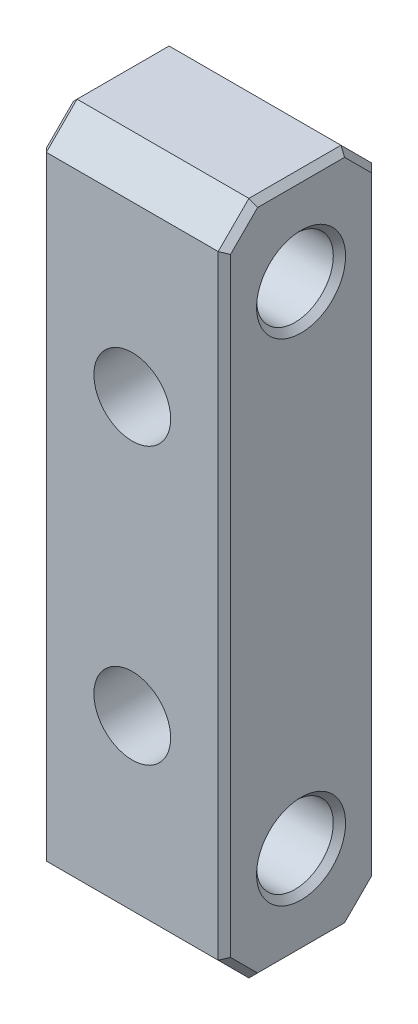
ISO-10303-21;
HEADER;
FILE_DESCRIPTION(('STEP AP214'),'2;1');
FILE_NAME('part.step','',(''),(''),'','','');
FILE_SCHEMA(('AUTOMOTIVE_DESIGN { 1 0 10303 214 1 1 1 1 }'));
ENDSEC;
DATA;
#1=APPLICATION_CONTEXT('core data for automotive mechanical design processes');
#2=APPLICATION_PROTOCOL_DEFINITION('international standard','automotive_design',2000,#1);
#3=PRODUCT_CONTEXT('',#1,'mechanical');
#4=PRODUCT('Part','Part','',(#3));
#5=PRODUCT_RELATED_PRODUCT_CATEGORY('part','',(#4));
#6=PRODUCT_DEFINITION_FORMATION('','',#4);
#7=PRODUCT_DEFINITION_CONTEXT('part definition',#1,'design');
#8=PRODUCT_DEFINITION('design','',#6,#7);
#9=PRODUCT_DEFINITION_SHAPE('','',#8);
#10=(LENGTH_UNIT() NAMED_UNIT(*) SI_UNIT(.MILLI.,.METRE.));
#11=(NAMED_UNIT(*) PLANE_ANGLE_UNIT() SI_UNIT($,.RADIAN.));
#12=(NAMED_UNIT(*) SI_UNIT($,.STERADIAN.) SOLID_ANGLE_UNIT());
#13=UNCERTAINTY_MEASURE_WITH_UNIT(LENGTH_MEASURE(1.E-05),#10,'distance_accuracy_value','');
#14=(GEOMETRIC_REPRESENTATION_CONTEXT(3) GLOBAL_UNCERTAINTY_ASSIGNED_CONTEXT((#13)) GLOBAL_UNIT_ASSIGNED_CONTEXT((#10,
#11,#12)) REPRESENTATION_CONTEXT('',''));
#15=CARTESIAN_POINT('',(0.,0.,0.));
#16=DIRECTION('',(0.,0.,1.));
#17=DIRECTION('',(1.,0.,0.));
#18=AXIS2_PLACEMENT_3D('',#15,#16,#17);
#19=CARTESIAN_POINT('',(3.,11.,2.5));
#20=DIRECTION('',(-1.,0.,0.));
#21=DIRECTION('',(0.,-1.,0.));
#22=AXIS2_PLACEMENT_3D('',#19,#20,#21);
#23=PLANE('',#22);
#24=DIRECTION('',(0.,-1.,0.));
#25=VECTOR('',#24,1.);
#26=CARTESIAN_POINT('',(3.,-10.,2.3));
#27=LINE('',#26,#25);
#28=CARTESIAN_POINT('',(3.,9.91715728752538,2.3));
#29=VERTEX_POINT('',#28);
#30=CARTESIAN_POINT('',(3.,-9.91715728752538,2.3));
#31=VERTEX_POINT('',#30);
#32=EDGE_CURVE('E47',#29,#31,#27,.T.);
#33=ORIENTED_EDGE('',*,*,#32,.T.);
#34=DIRECTION('',(0.,-0.707106781186548,-0.707106781186548));
#35=VECTOR('',#34,1.);
#36=CARTESIAN_POINT('',(3.,-10.8585786437627,1.35857864376269));
#37=LINE('',#36,#35);
#38=CARTESIAN_POINT('',(3.,-10.8,1.41715728752538));
#39=VERTEX_POINT('',#38);
#40=EDGE_CURVE('E11',#31,#39,#37,.T.);
#41=ORIENTED_EDGE('',*,*,#40,.T.);
#42=DIRECTION('',(0.,0.,-1.));
#43=VECTOR('',#42,1.);
#44=CARTESIAN_POINT('',(3.,-10.8,2.5));
#45=LINE('',#44,#43);
#46=CARTESIAN_POINT('',(3.,-10.8,-1.41715728752538));
#47=VERTEX_POINT('',#46);
#48=EDGE_CURVE('E233',#39,#47,#45,.T.);
#49=ORIENTED_EDGE('',*,*,#48,.T.);
#50=DIRECTION('',(0.,0.707106781186549,-0.707106781186546));
#51=VECTOR('',#50,1.);
#52=CARTESIAN_POINT('',(3.,-9.85857864376268,-2.35857864376269));
#53=LINE('',#52,#51);
#54=CARTESIAN_POINT('',(3.,-9.91715728752538,-2.3));
#55=VERTEX_POINT('',#54);
#56=EDGE_CURVE('E235',#47,#55,#53,.T.);
#57=ORIENTED_EDGE('',*,*,#56,.T.);
#58=DIRECTION('',(0.,1.,0.));
#59=VECTOR('',#58,1.);
#60=CARTESIAN_POINT('',(3.,11.,-2.3));
#61=LINE('',#60,#59);
#62=CARTESIAN_POINT('',(3.,9.91715728752538,-2.3));
#63=VERTEX_POINT('',#62);
#64=EDGE_CURVE('E237',#55,#63,#61,.T.);
#65=ORIENTED_EDGE('',*,*,#64,.T.);
#66=DIRECTION('',(0.,0.707106781186549,0.707106781186546));
#67=VECTOR('',#66,1.);
#68=CARTESIAN_POINT('',(3.,10.8585786437627,-1.35857864376269));
#69=LINE('',#68,#67);
#70=CARTESIAN_POINT('',(3.,10.8,-1.41715728752538));
#71=VERTEX_POINT('',#70);
#72=EDGE_CURVE('E239',#63,#71,#69,.T.);
#73=ORIENTED_EDGE('',*,*,#72,.T.);
#74=DIRECTION('',(0.,0.,1.));
#75=VECTOR('',#74,1.);
#76=CARTESIAN_POINT('',(3.,10.8,2.5));
#77=LINE('',#76,#75);
#78=CARTESIAN_POINT('',(3.,10.8,1.41715728752538));
#79=VERTEX_POINT('',#78);
#80=EDGE_CURVE('E241',#71,#79,#77,.T.);
#81=ORIENTED_EDGE('',*,*,#80,.T.);
#82=DIRECTION('',(0.,-0.707106781186548,0.707106781186548));
#83=VECTOR('',#82,1.);
#84=CARTESIAN_POINT('',(3.,9.85857864376269,2.35857864376269));
#85=LINE('',#84,#83);
#86=EDGE_CURVE('E58',#79,#29,#85,.T.);
#87=ORIENTED_EDGE('',*,*,#86,.T.);
#88=EDGE_LOOP('',(#33,#41,#49,#57,#65,#73,#81,#87));
#89=FACE_BOUND('',#88,.T.);
#90=CARTESIAN_POINT('',(3.,-8.,0.));
#91=DIRECTION('',(-1.,0.,0.));
#92=DIRECTION('',(0.,-1.,0.));
#93=AXIS2_PLACEMENT_3D('',#90,#91,#92);
#94=CIRCLE('',#93,1.45000000000001);
#95=CARTESIAN_POINT('',(3.,-9.45000000000001,0.));
#96=VERTEX_POINT('',#95);
#97=EDGE_CURVE('E230',#96,#96,#94,.T.);
#98=ORIENTED_EDGE('',*,*,#97,.T.);
#99=EDGE_LOOP('',(#98));
#100=FACE_BOUND('',#99,.T.);
#101=CARTESIAN_POINT('',(3.,8.,0.));
#102=DIRECTION('',(-1.,0.,0.));
#103=DIRECTION('',(0.,-1.,0.));
#104=AXIS2_PLACEMENT_3D('',#101,#102,#103);
#105=CIRCLE('',#104,1.45);
#106=CARTESIAN_POINT('',(3.,6.55,0.));
#107=VERTEX_POINT('',#106);
#108=EDGE_CURVE('E227',#107,#107,#105,.T.);
#109=ORIENTED_EDGE('',*,*,#108,.T.);
#110=EDGE_LOOP('',(#109));
#111=FACE_BOUND('',#110,.T.);
#112=ADVANCED_FACE('F38',(#89,#100,#111),#23,.F.);
#113=CARTESIAN_POINT('',(-3.,11.,2.5));
#114=DIRECTION('',(0.,-1.,0.));
#115=DIRECTION('',(0.,0.,-1.));
#116=AXIS2_PLACEMENT_3D('',#113,#114,#115);
#117=PLANE('',#116);
#118=DIRECTION('',(-1.,0.,0.));
#119=VECTOR('',#118,1.);
#120=CARTESIAN_POINT('',(-3.,11.,-1.5));
#121=LINE('',#120,#119);
#122=CARTESIAN_POINT('',(2.8,11.,-1.5));
#123=VERTEX_POINT('',#122);
#124=CARTESIAN_POINT('',(-2.8,11.,-1.5));
#125=VERTEX_POINT('',#124);
#126=EDGE_CURVE('E302',#123,#125,#121,.T.);
#127=ORIENTED_EDGE('',*,*,#126,.T.);
#128=DIRECTION('',(0.,0.,1.));
#129=VECTOR('',#128,1.);
#130=CARTESIAN_POINT('',(-2.8,11.,2.5));
#131=LINE('',#130,#129);
#132=CARTESIAN_POINT('',(-2.8,11.,1.5));
#133=VERTEX_POINT('',#132);
#134=EDGE_CURVE('E188',#125,#133,#131,.T.);
#135=ORIENTED_EDGE('',*,*,#134,.T.);
#136=DIRECTION('',(1.,0.,0.));
#137=VECTOR('',#136,1.);
#138=CARTESIAN_POINT('',(3.,11.,1.5));
#139=LINE('',#138,#137);
#140=CARTESIAN_POINT('',(2.8,11.,1.5));
#141=VERTEX_POINT('',#140);
#142=EDGE_CURVE('E322',#133,#141,#139,.T.);
#143=ORIENTED_EDGE('',*,*,#142,.T.);
#144=DIRECTION('',(0.,0.,-1.));
#145=VECTOR('',#144,1.);
#146=CARTESIAN_POINT('',(2.8,11.,2.5));
#147=LINE('',#146,#145);
#148=EDGE_CURVE('E186',#141,#123,#147,.T.);
#149=ORIENTED_EDGE('',*,*,#148,.T.);
#150=EDGE_LOOP('',(#127,#135,#143,#149));
#151=FACE_BOUND('',#150,.T.);
#152=ADVANCED_FACE('F349',(#151),#117,.F.);
#153=CARTESIAN_POINT('',(-3.,11.,2.5));
#154=DIRECTION('',(1.,0.,0.));
#155=DIRECTION('',(0.,1.,0.));
#156=AXIS2_PLACEMENT_3D('',#153,#154,#155);
#157=PLANE('',#156);
#158=DIRECTION('',(0.,0.,-1.));
#159=VECTOR('',#158,1.);
#160=CARTESIAN_POINT('',(-3.,10.8,2.5));
#161=LINE('',#160,#159);
#162=CARTESIAN_POINT('',(-3.,10.8,1.41715728752538));
#163=VERTEX_POINT('',#162);
#164=CARTESIAN_POINT('',(-3.,10.8,-1.41715728752538));
#165=VERTEX_POINT('',#164);
#166=EDGE_CURVE('E176',#163,#165,#161,.T.);
#167=ORIENTED_EDGE('',*,*,#166,.T.);
#168=DIRECTION('',(0.,-0.707106781186549,-0.707106781186546));
#169=VECTOR('',#168,1.);
#170=CARTESIAN_POINT('',(-3.,9.85857864376269,-2.35857864376269));
#171=LINE('',#170,#169);
#172=CARTESIAN_POINT('',(-3.,9.91715728752538,-2.3));
#173=VERTEX_POINT('',#172);
#174=EDGE_CURVE('E156',#165,#173,#171,.T.);
#175=ORIENTED_EDGE('',*,*,#174,.T.);
#176=DIRECTION('',(0.,-1.,0.));
#177=VECTOR('',#176,1.);
#178=CARTESIAN_POINT('',(-3.,11.,-2.3));
#179=LINE('',#178,#177);
#180=CARTESIAN_POINT('',(-3.,-9.91715728752537,-2.3));
#181=VERTEX_POINT('',#180);
#182=EDGE_CURVE('E164',#173,#181,#179,.T.);
#183=ORIENTED_EDGE('',*,*,#182,.T.);
#184=DIRECTION('',(0.,-0.707106781186549,0.707106781186546));
#185=VECTOR('',#184,1.);
#186=CARTESIAN_POINT('',(-3.,-10.8585786437627,-1.35857864376269));
#187=LINE('',#186,#185);
#188=CARTESIAN_POINT('',(-3.,-10.8,-1.41715728752538));
#189=VERTEX_POINT('',#188);
#190=EDGE_CURVE('E170',#181,#189,#187,.T.);
#191=ORIENTED_EDGE('',*,*,#190,.T.);
#192=DIRECTION('',(0.,0.,1.));
#193=VECTOR('',#192,1.);
#194=CARTESIAN_POINT('',(-3.,-10.8,2.5));
#195=LINE('',#194,#193);
#196=CARTESIAN_POINT('',(-3.,-10.8,1.41715728752538));
#197=VERTEX_POINT('',#196);
#198=EDGE_CURVE('E332',#189,#197,#195,.T.);
#199=ORIENTED_EDGE('',*,*,#198,.T.);
#200=DIRECTION('',(0.,0.707106781186548,0.707106781186548));
#201=VECTOR('',#200,1.);
#202=CARTESIAN_POINT('',(-3.,-9.85857864376269,2.35857864376269));
#203=LINE('',#202,#201);
#204=CARTESIAN_POINT('',(-3.,-9.91715728752538,2.3));
#205=VERTEX_POINT('',#204);
#206=EDGE_CURVE('E334',#197,#205,#203,.T.);
#207=ORIENTED_EDGE('',*,*,#206,.T.);
#208=DIRECTION('',(0.,1.,0.));
#209=VECTOR('',#208,1.);
#210=CARTESIAN_POINT('',(-3.,10.,2.3));
#211=LINE('',#210,#209);
#212=CARTESIAN_POINT('',(-3.,9.91715728752538,2.3));
#213=VERTEX_POINT('',#212);
#214=EDGE_CURVE('E336',#205,#213,#211,.T.);
#215=ORIENTED_EDGE('',*,*,#214,.T.);
#216=DIRECTION('',(0.,0.707106781186548,-0.707106781186548));
#217=VECTOR('',#216,1.);
#218=CARTESIAN_POINT('',(-3.,10.8585786437627,1.35857864376268));
#219=LINE('',#218,#217);
#220=EDGE_CURVE('E181',#213,#163,#219,.T.);
#221=ORIENTED_EDGE('',*,*,#220,.T.);
#222=EDGE_LOOP('',(#167,#175,#183,#191,#199,#207,#215,#221));
#223=FACE_BOUND('',#222,.T.);
#224=CARTESIAN_POINT('',(-3.,-8.,0.));
#225=DIRECTION('',(1.,0.,0.));
#226=DIRECTION('',(0.,1.,0.));
#227=AXIS2_PLACEMENT_3D('',#224,#225,#226);
#228=CIRCLE('',#227,1.45000000000001);
#229=CARTESIAN_POINT('',(-3.,-8.,1.45000000000001));
#230=VERTEX_POINT('',#229);
#231=EDGE_CURVE('E171',#230,#230,#228,.T.);
#232=ORIENTED_EDGE('',*,*,#231,.T.);
#233=EDGE_LOOP('',(#232));
#234=FACE_BOUND('',#233,.T.);
#235=CARTESIAN_POINT('',(-3.,8.,0.));
#236=DIRECTION('',(1.,0.,0.));
#237=DIRECTION('',(0.,1.,0.));
#238=AXIS2_PLACEMENT_3D('',#235,#236,#237);
#239=CIRCLE('',#238,1.45);
#240=CARTESIAN_POINT('',(-3.,9.45,0.));
#241=VERTEX_POINT('',#240);
#242=EDGE_CURVE('E326',#241,#241,#239,.T.);
#243=ORIENTED_EDGE('',*,*,#242,.T.);
#244=EDGE_LOOP('',(#243));
#245=FACE_BOUND('',#244,.T.);
#246=ADVANCED_FACE('F173',(#223,#234,#245),#157,.F.);
#247=CARTESIAN_POINT('',(-3.,-11.,2.5));
#248=DIRECTION('',(0.,1.,0.));
#249=DIRECTION('',(0.,0.,1.));
#250=AXIS2_PLACEMENT_3D('',#247,#248,#249);
#251=PLANE('',#250);
#252=DIRECTION('',(-1.,0.,0.));
#253=VECTOR('',#252,1.);
#254=CARTESIAN_POINT('',(-3.,-11.,1.5));
#255=LINE('',#254,#253);
#256=CARTESIAN_POINT('',(2.8,-11.,1.5));
#257=VERTEX_POINT('',#256);
#258=CARTESIAN_POINT('',(-2.8,-11.,1.5));
#259=VERTEX_POINT('',#258);
#260=EDGE_CURVE('E313',#257,#259,#255,.T.);
#261=ORIENTED_EDGE('',*,*,#260,.T.);
#262=DIRECTION('',(0.,0.,-1.));
#263=VECTOR('',#262,1.);
#264=CARTESIAN_POINT('',(-2.8,-11.,2.5));
#265=LINE('',#264,#263);
#266=CARTESIAN_POINT('',(-2.8,-11.,-1.5));
#267=VERTEX_POINT('',#266);
#268=EDGE_CURVE('E205',#259,#267,#265,.T.);
#269=ORIENTED_EDGE('',*,*,#268,.T.);
#270=DIRECTION('',(1.,0.,0.));
#271=VECTOR('',#270,1.);
#272=CARTESIAN_POINT('',(-3.,-11.,-1.5));
#273=LINE('',#272,#271);
#274=CARTESIAN_POINT('',(2.8,-11.,-1.5));
#275=VERTEX_POINT('',#274);
#276=EDGE_CURVE('E308',#267,#275,#273,.T.);
#277=ORIENTED_EDGE('',*,*,#276,.T.);
#278=DIRECTION('',(0.,0.,1.));
#279=VECTOR('',#278,1.);
#280=CARTESIAN_POINT('',(2.8,-11.,2.5));
#281=LINE('',#280,#279);
#282=EDGE_CURVE('E203',#275,#257,#281,.T.);
#283=ORIENTED_EDGE('',*,*,#282,.T.);
#284=EDGE_LOOP('',(#261,#269,#277,#283));
#285=FACE_BOUND('',#284,.T.);
#286=ADVANCED_FACE('F378',(#285),#251,.F.);
#287=CARTESIAN_POINT('',(0.,0.,2.5));
#288=DIRECTION('',(0.,0.,1.));
#289=DIRECTION('',(1.,0.,0.));
#290=AXIS2_PLACEMENT_3D('',#287,#288,#289);
#291=PLANE('',#290);
#292=CARTESIAN_POINT('',(0.,4.5,2.5));
#293=DIRECTION('',(0.,0.,1.));
#294=DIRECTION('',(1.,0.,0.));
#295=AXIS2_PLACEMENT_3D('',#292,#293,#294);
#296=CIRCLE('',#295,1.25);
#297=CARTESIAN_POINT('',(1.25,4.5,2.5));
#298=VERTEX_POINT('',#297);
#299=EDGE_CURVE('E392',#298,#298,#296,.T.);
#300=ORIENTED_EDGE('',*,*,#299,.F.);
#301=EDGE_LOOP('',(#300));
#302=FACE_BOUND('',#301,.T.);
#303=CARTESIAN_POINT('',(0.,-4.5,2.5));
#304=DIRECTION('',(0.,0.,1.));
#305=DIRECTION('',(-1.,0.,0.));
#306=AXIS2_PLACEMENT_3D('',#303,#304,#305);
#307=CIRCLE('',#306,1.25);
#308=CARTESIAN_POINT('',(-1.25,-4.5,2.5));
#309=VERTEX_POINT('',#308);
#310=EDGE_CURVE('E262',#309,#309,#307,.T.);
#311=ORIENTED_EDGE('',*,*,#310,.F.);
#312=EDGE_LOOP('',(#311));
#313=FACE_BOUND('',#312,.T.);
#314=DIRECTION('',(-1.,0.,0.));
#315=VECTOR('',#314,1.);
#316=CARTESIAN_POINT('',(-3.,10.,2.5));
#317=LINE('',#316,#315);
#318=CARTESIAN_POINT('',(2.8,10.,2.5));
#319=VERTEX_POINT('',#318);
#320=CARTESIAN_POINT('',(-2.8,10.,2.5));
#321=VERTEX_POINT('',#320);
#322=EDGE_CURVE('E310',#319,#321,#317,.T.);
#323=ORIENTED_EDGE('',*,*,#322,.T.);
#324=DIRECTION('',(0.,-1.,0.));
#325=VECTOR('',#324,1.);
#326=CARTESIAN_POINT('',(-2.8,-10.,2.5));
#327=LINE('',#326,#325);
#328=CARTESIAN_POINT('',(-2.8,-10.,2.5));
#329=VERTEX_POINT('',#328);
#330=EDGE_CURVE('E196',#321,#329,#327,.T.);
#331=ORIENTED_EDGE('',*,*,#330,.T.);
#332=DIRECTION('',(1.,0.,0.));
#333=VECTOR('',#332,1.);
#334=CARTESIAN_POINT('',(3.,-10.,2.5));
#335=LINE('',#334,#333);
#336=CARTESIAN_POINT('',(2.8,-10.,2.5));
#337=VERTEX_POINT('',#336);
#338=EDGE_CURVE('E319',#329,#337,#335,.T.);
#339=ORIENTED_EDGE('',*,*,#338,.T.);
#340=DIRECTION('',(0.,1.,0.));
#341=VECTOR('',#340,1.);
#342=CARTESIAN_POINT('',(2.8,10.,2.5));
#343=LINE('',#342,#341);
#344=EDGE_CURVE('E194',#337,#319,#343,.T.);
#345=ORIENTED_EDGE('',*,*,#344,.T.);
#346=EDGE_LOOP('',(#323,#331,#339,#345));
#347=FACE_BOUND('',#346,.T.);
#348=ADVANCED_FACE('F401',(#302,#313,#347),#291,.T.);
#349=CARTESIAN_POINT('',(0.,0.,-2.5));
#350=DIRECTION('',(0.,0.,1.));
#351=DIRECTION('',(1.,0.,0.));
#352=AXIS2_PLACEMENT_3D('',#349,#350,#351);
#353=PLANE('',#352);
#354=CARTESIAN_POINT('',(0.,4.5,-2.5));
#355=DIRECTION('',(0.,0.,1.));
#356=DIRECTION('',(1.,0.,0.));
#357=AXIS2_PLACEMENT_3D('',#354,#355,#356);
#358=CIRCLE('',#357,1.25);
#359=CARTESIAN_POINT('',(1.25,4.5,-2.5));
#360=VERTEX_POINT('',#359);
#361=EDGE_CURVE('E385',#360,#360,#358,.T.);
#362=ORIENTED_EDGE('',*,*,#361,.T.);
#363=EDGE_LOOP('',(#362));
#364=FACE_BOUND('',#363,.T.);
#365=CARTESIAN_POINT('',(0.,-4.5,-2.5));
#366=DIRECTION('',(0.,0.,1.));
#367=DIRECTION('',(1.,0.,0.));
#368=AXIS2_PLACEMENT_3D('',#365,#366,#367);
#369=CIRCLE('',#368,1.25);
#370=CARTESIAN_POINT('',(1.25,-4.5,-2.5));
#371=VERTEX_POINT('',#370);
#372=EDGE_CURVE('E387',#371,#371,#369,.T.);
#373=ORIENTED_EDGE('',*,*,#372,.T.);
#374=EDGE_LOOP('',(#373));
#375=FACE_BOUND('',#374,.T.);
#376=DIRECTION('',(-1.,0.,0.));
#377=VECTOR('',#376,1.);
#378=CARTESIAN_POINT('',(0.,-9.99999999999999,-2.5));
#379=LINE('',#378,#377);
#380=CARTESIAN_POINT('',(2.8,-9.99999999999999,-2.5));
#381=VERTEX_POINT('',#380);
#382=CARTESIAN_POINT('',(-2.8,-9.99999999999999,-2.5));
#383=VERTEX_POINT('',#382);
#384=EDGE_CURVE('E307',#381,#383,#379,.T.);
#385=ORIENTED_EDGE('',*,*,#384,.T.);
#386=DIRECTION('',(0.,1.,0.));
#387=VECTOR('',#386,1.);
#388=CARTESIAN_POINT('',(-2.8,0.,-2.5));
#389=LINE('',#388,#387);
#390=CARTESIAN_POINT('',(-2.8,10.,-2.5));
#391=VERTEX_POINT('',#390);
#392=EDGE_CURVE('E213',#383,#391,#389,.T.);
#393=ORIENTED_EDGE('',*,*,#392,.T.);
#394=DIRECTION('',(1.,0.,0.));
#395=VECTOR('',#394,1.);
#396=CARTESIAN_POINT('',(0.,10.,-2.5));
#397=LINE('',#396,#395);
#398=CARTESIAN_POINT('',(2.8,10.,-2.5));
#399=VERTEX_POINT('',#398);
#400=EDGE_CURVE('E300',#391,#399,#397,.T.);
#401=ORIENTED_EDGE('',*,*,#400,.T.);
#402=DIRECTION('',(0.,-1.,0.));
#403=VECTOR('',#402,1.);
#404=CARTESIAN_POINT('',(2.8,0.,-2.5));
#405=LINE('',#404,#403);
#406=EDGE_CURVE('E211',#399,#381,#405,.T.);
#407=ORIENTED_EDGE('',*,*,#406,.T.);
#408=EDGE_LOOP('',(#385,#393,#401,#407));
#409=FACE_BOUND('',#408,.T.);
#410=ADVANCED_FACE('F305',(#364,#375,#409),#353,.F.);
#411=CARTESIAN_POINT('',(0.,-4.5,-6.5));
#412=DIRECTION('',(0.,0.,1.));
#413=DIRECTION('',(1.,0.,0.));
#414=AXIS2_PLACEMENT_3D('',#411,#412,#413);
#415=CYLINDRICAL_SURFACE('',#414,1.25);
#416=ORIENTED_EDGE('',*,*,#310,.T.);
#417=EDGE_LOOP('',(#416));
#418=FACE_BOUND('',#417,.T.);
#419=ORIENTED_EDGE('',*,*,#372,.F.);
#420=EDGE_LOOP('',(#419));
#421=FACE_BOUND('',#420,.T.);
#422=ADVANCED_FACE('F643',(#418,#421),#415,.F.);
#423=CARTESIAN_POINT('',(0.,4.5,-6.5));
#424=DIRECTION('',(0.,0.,1.));
#425=DIRECTION('',(1.,0.,0.));
#426=AXIS2_PLACEMENT_3D('',#423,#424,#425);
#427=CYLINDRICAL_SURFACE('',#426,1.25);
#428=ORIENTED_EDGE('',*,*,#299,.T.);
#429=EDGE_LOOP('',(#428));
#430=FACE_BOUND('',#429,.T.);
#431=ORIENTED_EDGE('',*,*,#361,.F.);
#432=EDGE_LOOP('',(#431));
#433=FACE_BOUND('',#432,.T.);
#434=ADVANCED_FACE('F398',(#430,#433),#427,.F.);
#435=CARTESIAN_POINT('',(6.,-8.,0.));
#436=DIRECTION('',(-1.,0.,0.));
#437=DIRECTION('',(0.,-1.,0.));
#438=AXIS2_PLACEMENT_3D('',#435,#436,#437);
#439=CYLINDRICAL_SURFACE('',#438,1.25);
#440=CARTESIAN_POINT('',(-2.79999999999999,-8.,0.));
#441=DIRECTION('',(1.,0.,0.));
#442=DIRECTION('',(0.,0.,-1.));
#443=AXIS2_PLACEMENT_3D('',#440,#441,#442);
#444=CIRCLE('',#443,1.25);
#445=CARTESIAN_POINT('',(-2.79999999999999,-8.,1.25));
#446=VERTEX_POINT('',#445);
#447=EDGE_CURVE('E218',#446,#446,#444,.F.);
#448=ORIENTED_EDGE('',*,*,#447,.T.);
#449=EDGE_LOOP('',(#448));
#450=FACE_BOUND('',#449,.T.);
#451=CARTESIAN_POINT('',(2.79999999999999,-8.,0.));
#452=DIRECTION('',(-1.,0.,0.));
#453=DIRECTION('',(0.,0.,1.));
#454=AXIS2_PLACEMENT_3D('',#451,#452,#453);
#455=CIRCLE('',#454,1.25);
#456=CARTESIAN_POINT('',(2.79999999999999,-8.,1.25));
#457=VERTEX_POINT('',#456);
#458=EDGE_CURVE('E215',#457,#457,#455,.F.);
#459=ORIENTED_EDGE('',*,*,#458,.T.);
#460=EDGE_LOOP('',(#459));
#461=FACE_BOUND('',#460,.T.);
#462=ADVANCED_FACE('F623',(#450,#461),#439,.F.);
#463=CARTESIAN_POINT('',(6.,8.,0.));
#464=DIRECTION('',(-1.,0.,0.));
#465=DIRECTION('',(0.,-1.,0.));
#466=AXIS2_PLACEMENT_3D('',#463,#464,#465);
#467=CYLINDRICAL_SURFACE('',#466,1.25);
#468=CARTESIAN_POINT('',(-2.8,8.,0.));
#469=DIRECTION('',(1.,0.,0.));
#470=DIRECTION('',(0.,0.,-1.));
#471=AXIS2_PLACEMENT_3D('',#468,#469,#470);
#472=CIRCLE('',#471,1.25);
#473=CARTESIAN_POINT('',(-2.8,8.,-1.25));
#474=VERTEX_POINT('',#473);
#475=EDGE_CURVE('E224',#474,#474,#472,.F.);
#476=ORIENTED_EDGE('',*,*,#475,.T.);
#477=EDGE_LOOP('',(#476));
#478=FACE_BOUND('',#477,.T.);
#479=CARTESIAN_POINT('',(2.8,8.,0.));
#480=DIRECTION('',(-1.,0.,0.));
#481=DIRECTION('',(0.,0.,1.));
#482=AXIS2_PLACEMENT_3D('',#479,#480,#481);
#483=CIRCLE('',#482,1.25);
#484=CARTESIAN_POINT('',(2.8,8.,1.25));
#485=VERTEX_POINT('',#484);
#486=EDGE_CURVE('E221',#485,#485,#483,.F.);
#487=ORIENTED_EDGE('',*,*,#486,.T.);
#488=EDGE_LOOP('',(#487));
#489=FACE_BOUND('',#488,.T.);
#490=ADVANCED_FACE('F441',(#478,#489),#467,.F.);
#491=CARTESIAN_POINT('',(-3.,-11.,-1.5));
#492=DIRECTION('',(0.,0.707106781186546,0.707106781186549));
#493=DIRECTION('',(1.,0.,0.));
#494=AXIS2_PLACEMENT_3D('',#491,#492,#493);
#495=PLANE('',#494);
#496=ORIENTED_EDGE('',*,*,#276,.F.);
#497=DIRECTION('',(0.,-0.707106781186549,0.707106781186546));
#498=VECTOR('',#497,1.);
#499=CARTESIAN_POINT('',(-2.8,-9.99999999999999,-2.5));
#500=LINE('',#499,#498);
#501=EDGE_CURVE('E209',#267,#383,#500,.F.);
#502=ORIENTED_EDGE('',*,*,#501,.T.);
#503=ORIENTED_EDGE('',*,*,#384,.F.);
#504=DIRECTION('',(0.,0.707106781186549,-0.707106781186546));
#505=VECTOR('',#504,1.);
#506=CARTESIAN_POINT('',(2.8,-11.,-1.5));
#507=LINE('',#506,#505);
#508=EDGE_CURVE('E207',#381,#275,#507,.F.);
#509=ORIENTED_EDGE('',*,*,#508,.T.);
#510=EDGE_LOOP('',(#496,#502,#503,#509));
#511=FACE_BOUND('',#510,.T.);
#512=ADVANCED_FACE('F421',(#511),#495,.F.);
#513=CARTESIAN_POINT('',(0.,-10.,2.5));
#514=DIRECTION('',(0.,-0.707106781186548,0.707106781186548));
#515=DIRECTION('',(-1.,0.,0.));
#516=AXIS2_PLACEMENT_3D('',#513,#514,#515);
#517=PLANE('',#516);
#518=ORIENTED_EDGE('',*,*,#338,.F.);
#519=DIRECTION('',(0.,-0.707106781186548,-0.707106781186548));
#520=VECTOR('',#519,1.);
#521=CARTESIAN_POINT('',(-2.8,-11.,1.5));
#522=LINE('',#521,#520);
#523=EDGE_CURVE('E201',#329,#259,#522,.T.);
#524=ORIENTED_EDGE('',*,*,#523,.T.);
#525=ORIENTED_EDGE('',*,*,#260,.F.);
#526=DIRECTION('',(0.,0.707106781186548,0.707106781186548));
#527=VECTOR('',#526,1.);
#528=CARTESIAN_POINT('',(2.8,-10.,2.5));
#529=LINE('',#528,#527);
#530=EDGE_CURVE('E198',#257,#337,#529,.T.);
#531=ORIENTED_EDGE('',*,*,#530,.T.);
#532=EDGE_LOOP('',(#518,#524,#525,#531));
#533=FACE_BOUND('',#532,.T.);
#534=ADVANCED_FACE('F383',(#533),#517,.T.);
#535=CARTESIAN_POINT('',(-3.,11.,-1.5));
#536=DIRECTION('',(0.,-0.707106781186546,0.707106781186549));
#537=DIRECTION('',(-1.,0.,0.));
#538=AXIS2_PLACEMENT_3D('',#535,#536,#537);
#539=PLANE('',#538);
#540=ORIENTED_EDGE('',*,*,#400,.F.);
#541=DIRECTION('',(0.,-0.707106781186549,-0.707106781186546));
#542=VECTOR('',#541,1.);
#543=CARTESIAN_POINT('',(-2.8,11.,-1.5));
#544=LINE('',#543,#542);
#545=EDGE_CURVE('E158',#391,#125,#544,.F.);
#546=ORIENTED_EDGE('',*,*,#545,.T.);
#547=ORIENTED_EDGE('',*,*,#126,.F.);
#548=DIRECTION('',(0.,0.707106781186549,0.707106781186546));
#549=VECTOR('',#548,1.);
#550=CARTESIAN_POINT('',(2.8,10.,-2.5));
#551=LINE('',#550,#549);
#552=EDGE_CURVE('E178',#123,#399,#551,.F.);
#553=ORIENTED_EDGE('',*,*,#552,.T.);
#554=EDGE_LOOP('',(#540,#546,#547,#553));
#555=FACE_BOUND('',#554,.T.);
#556=ADVANCED_FACE('F299',(#555),#539,.F.);
#557=CARTESIAN_POINT('',(0.,10.,2.5));
#558=DIRECTION('',(0.,0.707106781186548,0.707106781186548));
#559=DIRECTION('',(1.,0.,0.));
#560=AXIS2_PLACEMENT_3D('',#557,#558,#559);
#561=PLANE('',#560);
#562=ORIENTED_EDGE('',*,*,#142,.F.);
#563=DIRECTION('',(0.,-0.707106781186548,0.707106781186548));
#564=VECTOR('',#563,1.);
#565=CARTESIAN_POINT('',(-2.8,10.,2.5));
#566=LINE('',#565,#564);
#567=EDGE_CURVE('E192',#133,#321,#566,.T.);
#568=ORIENTED_EDGE('',*,*,#567,.T.);
#569=ORIENTED_EDGE('',*,*,#322,.F.);
#570=DIRECTION('',(0.,0.707106781186548,-0.707106781186548));
#571=VECTOR('',#570,1.);
#572=CARTESIAN_POINT('',(2.8,11.,1.5));
#573=LINE('',#572,#571);
#574=EDGE_CURVE('E190',#319,#141,#573,.T.);
#575=ORIENTED_EDGE('',*,*,#574,.T.);
#576=EDGE_LOOP('',(#562,#568,#569,#575));
#577=FACE_BOUND('',#576,.T.);
#578=ADVANCED_FACE('F351',(#577),#561,.T.);
#579=CARTESIAN_POINT('',(-3.,0.641421356237312,12.8585786437627));
#580=DIRECTION('',(-0.707106781186549,-0.499999999999999,0.499999999999999));
#581=DIRECTION('',(0.,-0.707106781186548,-0.707106781186548));
#582=AXIS2_PLACEMENT_3D('',#579,#580,#581);
#583=PLANE('',#582);
#584=DIRECTION('',(0.678598344545846,-0.678598344545846,0.281084637714824));
#585=VECTOR('',#584,1.);
#586=CARTESIAN_POINT('',(-2.60925643016945,-11.1907435698305,1.57900857355928));
#587=LINE('',#586,#585);
#588=EDGE_CURVE('E256',#259,#197,#587,.F.);
#589=ORIENTED_EDGE('',*,*,#588,.F.);
#590=ORIENTED_EDGE('',*,*,#523,.F.);
#591=DIRECTION('',(-0.678598344545846,0.281084637714824,-0.678598344545846));
#592=VECTOR('',#591,1.);
#593=CARTESIAN_POINT('',(-0.151800779695089,-11.0969200329162,5.1481992203049));
#594=LINE('',#593,#592);
#595=EDGE_CURVE('E259',#205,#329,#594,.F.);
#596=ORIENTED_EDGE('',*,*,#595,.F.);
#597=ORIENTED_EDGE('',*,*,#206,.F.);
#598=EDGE_LOOP('',(#589,#590,#596,#597));
#599=FACE_BOUND('',#598,.T.);
#600=ADVANCED_FACE('F413',(#599),#583,.T.);
#601=CARTESIAN_POINT('',(-2.8,0.,2.5));
#602=DIRECTION('',(-0.707106781186547,0.,0.707106781186547));
#603=DIRECTION('',(0.,1.,0.));
#604=AXIS2_PLACEMENT_3D('',#601,#602,#603);
#605=PLANE('',#604);
#606=ORIENTED_EDGE('',*,*,#595,.T.);
#607=ORIENTED_EDGE('',*,*,#330,.F.);
#608=DIRECTION('',(-0.678598344545847,-0.281084637714822,-0.678598344545847));
#609=VECTOR('',#608,1.);
#610=CARTESIAN_POINT('',(-4.70743569830547,9.20991426440727,0.592564301694527));
#611=LINE('',#610,#609);
#612=EDGE_CURVE('E253',#213,#321,#611,.F.);
#613=ORIENTED_EDGE('',*,*,#612,.F.);
#614=ORIENTED_EDGE('',*,*,#214,.F.);
#615=EDGE_LOOP('',(#606,#607,#613,#614));
#616=FACE_BOUND('',#615,.T.);
#617=ADVANCED_FACE('F409',(#616),#605,.T.);
#618=CARTESIAN_POINT('',(-2.8,-11.,2.5));
#619=DIRECTION('',(0.707106781186547,0.707106781186547,0.));
#620=DIRECTION('',(0.,0.,-1.));
#621=AXIS2_PLACEMENT_3D('',#618,#619,#620);
#622=PLANE('',#621);
#623=ORIENTED_EDGE('',*,*,#588,.T.);
#624=ORIENTED_EDGE('',*,*,#198,.F.);
#625=DIRECTION('',(-0.678598344545848,0.678598344545848,0.281084637714818));
#626=VECTOR('',#625,1.);
#627=CARTESIAN_POINT('',(-5.41196757579654,-8.38803242420345,-0.418087605626304));
#628=LINE('',#627,#626);
#629=EDGE_CURVE('E250',#267,#189,#628,.T.);
#630=ORIENTED_EDGE('',*,*,#629,.F.);
#631=ORIENTED_EDGE('',*,*,#268,.F.);
#632=EDGE_LOOP('',(#623,#624,#630,#631));
#633=FACE_BOUND('',#632,.T.);
#634=ADVANCED_FACE('F418',(#633),#622,.F.);
#635=CARTESIAN_POINT('',(-3.,10.3585786437627,1.85857864376269));
#636=DIRECTION('',(-0.707106781186548,0.499999999999999,0.499999999999999));
#637=DIRECTION('',(0.,-0.707106781186548,0.707106781186548));
#638=AXIS2_PLACEMENT_3D('',#635,#636,#637);
#639=PLANE('',#638);
#640=ORIENTED_EDGE('',*,*,#612,.T.);
#641=ORIENTED_EDGE('',*,*,#567,.F.);
#642=DIRECTION('',(0.678598344545847,0.678598344545847,0.281084637714823));
#643=VECTOR('',#642,1.);
#644=CARTESIAN_POINT('',(-3.11907435698306,10.6809256430169,1.36783507393214));
#645=LINE('',#644,#643);
#646=EDGE_CURVE('E247',#163,#133,#645,.T.);
#647=ORIENTED_EDGE('',*,*,#646,.F.);
#648=ORIENTED_EDGE('',*,*,#220,.F.);
#649=EDGE_LOOP('',(#640,#641,#647,#648));
#650=FACE_BOUND('',#649,.T.);
#651=ADVANCED_FACE('F343',(#650),#639,.T.);
#652=CARTESIAN_POINT('',(-3.,-1.85857864376265,-10.3585786437627));
#653=DIRECTION('',(0.707106781186546,0.5,0.500000000000002));
#654=DIRECTION('',(0.,-0.707106781186549,0.707106781186546));
#655=AXIS2_PLACEMENT_3D('',#652,#653,#654);
#656=PLANE('',#655);
#657=ORIENTED_EDGE('',*,*,#629,.T.);
#658=ORIENTED_EDGE('',*,*,#190,.F.);
#659=DIRECTION('',(-0.678598344545848,0.281084637714816,0.678598344545848));
#660=VECTOR('',#659,1.);
#661=CARTESIAN_POINT('',(-6.98981325172956,-8.26452252732311,1.68981325172957));
#662=LINE('',#661,#660);
#663=EDGE_CURVE('E167',#383,#181,#662,.T.);
#664=ORIENTED_EDGE('',*,*,#663,.F.);
#665=ORIENTED_EDGE('',*,*,#501,.F.);
#666=EDGE_LOOP('',(#657,#658,#664,#665));
#667=FACE_BOUND('',#666,.T.);
#668=ADVANCED_FACE('F455',(#667),#656,.F.);
#669=CARTESIAN_POINT('',(-3.,10.8,2.5));
#670=DIRECTION('',(0.707106781186547,-0.707106781186547,0.));
#671=DIRECTION('',(0.,0.,-1.));
#672=AXIS2_PLACEMENT_3D('',#669,#670,#671);
#673=PLANE('',#672);
#674=ORIENTED_EDGE('',*,*,#646,.T.);
#675=ORIENTED_EDGE('',*,*,#134,.F.);
#676=DIRECTION('',(-0.678598344545847,-0.678598344545847,0.28108463771482));
#677=VECTOR('',#676,1.);
#678=CARTESIAN_POINT('',(-3.74717256461033,10.0528274353897,-1.10766827783069));
#679=LINE('',#678,#677);
#680=EDGE_CURVE('E161',#165,#125,#679,.F.);
#681=ORIENTED_EDGE('',*,*,#680,.F.);
#682=ORIENTED_EDGE('',*,*,#166,.F.);
#683=EDGE_LOOP('',(#674,#675,#681,#682));
#684=FACE_BOUND('',#683,.T.);
#685=ADVANCED_FACE('F346',(#684),#673,.F.);
#686=CARTESIAN_POINT('',(-3.,11.,-2.3));
#687=DIRECTION('',(0.707106781186547,0.,0.707106781186547));
#688=DIRECTION('',(0.,-1.,0.));
#689=AXIS2_PLACEMENT_3D('',#686,#687,#688);
#690=PLANE('',#689);
#691=ORIENTED_EDGE('',*,*,#663,.T.);
#692=ORIENTED_EDGE('',*,*,#182,.F.);
#693=DIRECTION('',(0.678598344545848,0.281084637714818,-0.678598344545848));
#694=VECTOR('',#693,1.);
#695=CARTESIAN_POINT('',(-2.7934547154576,10.002711145627,-2.5065452845424));
#696=LINE('',#695,#694);
#697=EDGE_CURVE('E152',#391,#173,#696,.F.);
#698=ORIENTED_EDGE('',*,*,#697,.F.);
#699=ORIENTED_EDGE('',*,*,#392,.F.);
#700=EDGE_LOOP('',(#691,#692,#698,#699));
#701=FACE_BOUND('',#700,.T.);
#702=ADVANCED_FACE('F165',(#701),#690,.F.);
#703=CARTESIAN_POINT('',(-3.,12.8585786437627,0.641421356237305));
#704=DIRECTION('',(0.707106781186547,-0.5,0.500000000000001));
#705=DIRECTION('',(0.,-0.707106781186549,-0.707106781186546));
#706=AXIS2_PLACEMENT_3D('',#703,#704,#705);
#707=PLANE('',#706);
#708=ORIENTED_EDGE('',*,*,#680,.T.);
#709=ORIENTED_EDGE('',*,*,#545,.F.);
#710=ORIENTED_EDGE('',*,*,#697,.T.);
#711=ORIENTED_EDGE('',*,*,#174,.F.);
#712=EDGE_LOOP('',(#708,#709,#710,#711));
#713=FACE_BOUND('',#712,.T.);
#714=ADVANCED_FACE('F154',(#713),#707,.F.);
#715=CARTESIAN_POINT('',(-2.79999999999999,-8.,0.));
#716=DIRECTION('',(-1.,0.,0.));
#717=DIRECTION('',(0.,0.,1.));
#718=AXIS2_PLACEMENT_3D('',#715,#716,#717);
#719=CONICAL_SURFACE('',#718,1.25,0.785398163397434);
#720=CARTESIAN_POINT('',(-3.,-8.,1.45000000000001));
#721=CARTESIAN_POINT('',(-2.99791666666667,-8.,1.44791666666667));
#722=CARTESIAN_POINT('',(-2.99583333333333,-8.,1.44583333333334));
#723=CARTESIAN_POINT('',(-2.99166666666666,-8.,1.44166666666667));
#724=CARTESIAN_POINT('',(-2.98958333333333,-8.,1.43958333333334));
#725=CARTESIAN_POINT('',(-2.98541666666666,-8.,1.43541666666667));
#726=CARTESIAN_POINT('',(-2.98333333333333,-8.,1.43333333333334));
#727=CARTESIAN_POINT('',(-2.97916666666666,-8.,1.42916666666667));
#728=CARTESIAN_POINT('',(-2.97708333333333,-8.,1.42708333333334));
#729=CARTESIAN_POINT('',(-2.97291666666666,-8.,1.42291666666667));
#730=CARTESIAN_POINT('',(-2.97083333333333,-8.,1.42083333333334));
#731=CARTESIAN_POINT('',(-2.96666666666666,-8.,1.41666666666667));
#732=CARTESIAN_POINT('',(-2.96458333333333,-8.,1.41458333333334));
#733=CARTESIAN_POINT('',(-2.96041666666666,-8.,1.41041666666667));
#734=CARTESIAN_POINT('',(-2.95833333333333,-8.,1.40833333333334));
#735=CARTESIAN_POINT('',(-2.95416666666666,-8.,1.40416666666667));
#736=CARTESIAN_POINT('',(-2.95208333333333,-8.,1.40208333333334));
#737=CARTESIAN_POINT('',(-2.94791666666666,-8.,1.39791666666667));
#738=CARTESIAN_POINT('',(-2.94583333333333,-8.,1.39583333333334));
#739=CARTESIAN_POINT('',(-2.94166666666666,-8.,1.39166666666667));
#740=CARTESIAN_POINT('',(-2.93958333333333,-8.,1.38958333333334));
#741=CARTESIAN_POINT('',(-2.93541666666666,-8.,1.38541666666667));
#742=CARTESIAN_POINT('',(-2.93333333333333,-8.,1.38333333333334));
#743=CARTESIAN_POINT('',(-2.92916666666666,-8.,1.37916666666667));
#744=CARTESIAN_POINT('',(-2.92708333333333,-8.,1.37708333333334));
#745=CARTESIAN_POINT('',(-2.92291666666666,-8.,1.37291666666667));
#746=CARTESIAN_POINT('',(-2.92083333333333,-8.,1.37083333333334));
#747=CARTESIAN_POINT('',(-2.91666666666666,-8.,1.36666666666667));
#748=CARTESIAN_POINT('',(-2.91458333333333,-8.,1.36458333333334));
#749=CARTESIAN_POINT('',(-2.91041666666666,-8.,1.36041666666667));
#750=CARTESIAN_POINT('',(-2.90833333333333,-8.,1.35833333333334));
#751=CARTESIAN_POINT('',(-2.90416666666666,-8.,1.35416666666667));
#752=CARTESIAN_POINT('',(-2.90208333333333,-8.,1.35208333333334));
#753=CARTESIAN_POINT('',(-2.89791666666666,-8.,1.34791666666667));
#754=CARTESIAN_POINT('',(-2.89583333333333,-8.,1.34583333333334));
#755=CARTESIAN_POINT('',(-2.89166666666666,-8.,1.34166666666667));
#756=CARTESIAN_POINT('',(-2.88958333333333,-8.,1.33958333333334));
#757=CARTESIAN_POINT('',(-2.88541666666666,-8.,1.33541666666667));
#758=CARTESIAN_POINT('',(-2.88333333333333,-8.,1.33333333333334));
#759=CARTESIAN_POINT('',(-2.87916666666666,-8.,1.32916666666667));
#760=CARTESIAN_POINT('',(-2.87708333333333,-8.,1.32708333333334));
#761=CARTESIAN_POINT('',(-2.87291666666666,-8.,1.32291666666667));
#762=CARTESIAN_POINT('',(-2.87083333333333,-8.,1.32083333333334));
#763=CARTESIAN_POINT('',(-2.86666666666666,-8.,1.31666666666667));
#764=CARTESIAN_POINT('',(-2.86458333333333,-8.,1.31458333333334));
#765=CARTESIAN_POINT('',(-2.86041666666666,-8.,1.31041666666667));
#766=CARTESIAN_POINT('',(-2.85833333333332,-8.,1.30833333333333));
#767=CARTESIAN_POINT('',(-2.85416666666666,-8.,1.30416666666667));
#768=CARTESIAN_POINT('',(-2.85208333333332,-8.,1.30208333333333));
#769=CARTESIAN_POINT('',(-2.84791666666666,-8.,1.29791666666667));
#770=CARTESIAN_POINT('',(-2.84583333333332,-8.,1.29583333333333));
#771=CARTESIAN_POINT('',(-2.84166666666666,-8.,1.29166666666667));
#772=CARTESIAN_POINT('',(-2.83958333333332,-8.,1.28958333333333));
#773=CARTESIAN_POINT('',(-2.83541666666666,-8.,1.28541666666667));
#774=CARTESIAN_POINT('',(-2.83333333333332,-8.,1.28333333333333));
#775=CARTESIAN_POINT('',(-2.82916666666666,-8.,1.27916666666667));
#776=CARTESIAN_POINT('',(-2.82708333333332,-8.,1.27708333333333));
#777=CARTESIAN_POINT('',(-2.82291666666666,-8.,1.27291666666667));
#778=CARTESIAN_POINT('',(-2.82083333333332,-8.,1.27083333333333));
#779=CARTESIAN_POINT('',(-2.81666666666666,-8.,1.26666666666667));
#780=CARTESIAN_POINT('',(-2.81458333333332,-8.,1.26458333333333));
#781=CARTESIAN_POINT('',(-2.81041666666666,-8.,1.26041666666667));
#782=CARTESIAN_POINT('',(-2.80833333333332,-8.,1.25833333333333));
#783=CARTESIAN_POINT('',(-2.80416666666666,-8.,1.25416666666667));
#784=CARTESIAN_POINT('',(-2.80208333333332,-8.,1.25208333333333));
#785=CARTESIAN_POINT('',(-2.79999999999999,-8.,1.25));
#786=B_SPLINE_CURVE_WITH_KNOTS('',3,(#720,#721,#722,#723,#724,#725,#726,#727,#728,#729,#730,
#731,#732,#733,#734,#735,#736,#737,#738,#739,#740,#741,#742,#743,#744,#745,#746,#747,#748,#749,
#750,#751,#752,#753,#754,#755,#756,#757,#758,#759,#760,#761,#762,#763,#764,#765,#766,#767,#768,
#769,#770,#771,#772,#773,#774,#775,#776,#777,#778,#779,#780,#781,#782,#783,#784,#785),
.UNSPECIFIED.,.F.,.F.,(4,2,2,2,2,2,2,2,2,2,2,2,2,2,2,2,2,2,2,2,2,2,2,2,2,2,2,2,2,2,2,2,4),(0.,
0.0088388347648321,0.0176776695296642,0.0265165042944966,0.0353553390593287,0.0441941738241608,
0.053033008588993,0.0618718433538251,0.0707106781186572,0.0795495128834897,0.0883883476483218,
0.0972271824131539,0.106066017177986,0.114904851942818,0.12374368670765,0.132582521472483,
0.141421356237315,0.150260191002147,0.159099025766979,0.167937860531811,0.176776695296643,
0.185615530061476,0.194454364826308,0.20329319959114,0.212132034355972,0.220970869120804,
0.229809703885637,0.238648538650469,0.247487373415301,0.256326208180133,0.265165042944965,
0.274003877709797,0.28284271247463),.UNSPECIFIED.);
#787=EDGE_CURVE('BSEAM450',#230,#446,#786,.T.);
#788=ORIENTED_EDGE('',*,*,#231,.F.);
#789=ORIENTED_EDGE('',*,*,#447,.F.);
#790=ORIENTED_EDGE('',*,*,#787,.T.);
#791=ORIENTED_EDGE('',*,*,#787,.F.);
#792=EDGE_LOOP('',(#788,#790,#789,#791));
#793=FACE_BOUND('',#792,.T.);
#794=ADVANCED_FACE('F450',(#793),#719,.F.);
#795=CARTESIAN_POINT('',(-2.8,8.,0.));
#796=DIRECTION('',(-1.,0.,0.));
#797=DIRECTION('',(0.,0.,1.));
#798=AXIS2_PLACEMENT_3D('',#795,#796,#797);
#799=CONICAL_SURFACE('',#798,1.25,0.78539816339745);
#800=ORIENTED_EDGE('',*,*,#242,.F.);
#801=EDGE_LOOP('',(#800));
#802=FACE_BOUND('',#801,.T.);
#803=ORIENTED_EDGE('',*,*,#475,.F.);
#804=EDGE_LOOP('',(#803));
#805=FACE_BOUND('',#804,.T.);
#806=ADVANCED_FACE('F469',(#802,#805),#799,.F.);
#807=CARTESIAN_POINT('',(3.,12.8585786437627,0.641421356237305));
#808=DIRECTION('',(-0.707106781186554,-0.499999999999995,0.499999999999997));
#809=DIRECTION('',(0.,0.707106781186549,0.707106781186546));
#810=AXIS2_PLACEMENT_3D('',#807,#808,#809);
#811=PLANE('',#810);
#812=DIRECTION('',(0.678598344545841,-0.281084637714821,0.678598344545853));
#813=VECTOR('',#812,1.);
#814=CARTESIAN_POINT('',(2.7934547154576,10.002711145627,-2.5065452845424));
#815=LINE('',#814,#813);
#816=EDGE_CURVE('E278',#399,#63,#815,.T.);
#817=ORIENTED_EDGE('',*,*,#816,.F.);
#818=ORIENTED_EDGE('',*,*,#552,.F.);
#819=DIRECTION('',(0.678598344545841,-0.678598344545853,0.281084637714823));
#820=VECTOR('',#819,1.);
#821=CARTESIAN_POINT('',(2.44469399850851,11.3553060014915,-1.64717256461033));
#822=LINE('',#821,#820);
#823=EDGE_CURVE('E42',#71,#123,#822,.F.);
#824=ORIENTED_EDGE('',*,*,#823,.F.);
#825=ORIENTED_EDGE('',*,*,#72,.F.);
#826=EDGE_LOOP('',(#817,#818,#824,#825));
#827=FACE_BOUND('',#826,.T.);
#828=ADVANCED_FACE('F294',(#827),#811,.F.);
#829=CARTESIAN_POINT('',(2.8,11.,2.5));
#830=DIRECTION('',(-0.707106781186554,-0.707106781186541,0.));
#831=DIRECTION('',(0.,0.,-1.));
#832=AXIS2_PLACEMENT_3D('',#829,#830,#831);
#833=PLANE('',#832);
#834=ORIENTED_EDGE('',*,*,#823,.T.);
#835=ORIENTED_EDGE('',*,*,#148,.F.);
#836=DIRECTION('',(-0.678598344545841,0.678598344545852,0.281084637714823));
#837=VECTOR('',#836,1.);
#838=CARTESIAN_POINT('',(2.60925643016945,11.1907435698306,1.57900857355927));
#839=LINE('',#838,#837);
#840=EDGE_CURVE('E276',#79,#141,#839,.T.);
#841=ORIENTED_EDGE('',*,*,#840,.F.);
#842=ORIENTED_EDGE('',*,*,#80,.F.);
#843=EDGE_LOOP('',(#834,#835,#841,#842));
#844=FACE_BOUND('',#843,.T.);
#845=ADVANCED_FACE('F289',(#844),#833,.F.);
#846=CARTESIAN_POINT('',(3.,11.,-2.3));
#847=DIRECTION('',(-0.707106781186554,0.,0.707106781186541));
#848=DIRECTION('',(0.,1.,0.));
#849=AXIS2_PLACEMENT_3D('',#846,#847,#848);
#850=PLANE('',#849);
#851=ORIENTED_EDGE('',*,*,#816,.T.);
#852=ORIENTED_EDGE('',*,*,#64,.F.);
#853=DIRECTION('',(0.678598344545842,0.281084637714817,0.678598344545853));
#854=VECTOR('',#853,1.);
#855=CARTESIAN_POINT('',(0.826181138169574,-10.817582542238,-4.47381886183046));
#856=LINE('',#855,#854);
#857=EDGE_CURVE('E273',#381,#55,#856,.T.);
#858=ORIENTED_EDGE('',*,*,#857,.F.);
#859=ORIENTED_EDGE('',*,*,#406,.F.);
#860=EDGE_LOOP('',(#851,#852,#858,#859));
#861=FACE_BOUND('',#860,.T.);
#862=ADVANCED_FACE('F422',(#861),#850,.F.);
#863=CARTESIAN_POINT('',(3.,10.3585786437627,1.85857864376269));
#864=DIRECTION('',(0.707106781186554,0.499999999999996,0.499999999999996));
#865=DIRECTION('',(0.,0.707106781186548,-0.707106781186548));
#866=AXIS2_PLACEMENT_3D('',#863,#864,#865);
#867=PLANE('',#866);
#868=ORIENTED_EDGE('',*,*,#840,.T.);
#869=ORIENTED_EDGE('',*,*,#574,.F.);
#870=DIRECTION('',(0.678598344545841,-0.281084637714823,-0.678598344545852));
#871=VECTOR('',#870,1.);
#872=CARTESIAN_POINT('',(3.11907435698305,9.86783507393214,2.18092564301694));
#873=LINE('',#872,#871);
#874=EDGE_CURVE('E270',#29,#319,#873,.F.);
#875=ORIENTED_EDGE('',*,*,#874,.F.);
#876=ORIENTED_EDGE('',*,*,#86,.F.);
#877=EDGE_LOOP('',(#868,#869,#875,#876));
#878=FACE_BOUND('',#877,.T.);
#879=ADVANCED_FACE('F355',(#878),#867,.T.);
#880=CARTESIAN_POINT('',(3.,-1.85857864376265,-10.3585786437627));
#881=DIRECTION('',(-0.707106781186552,0.499999999999996,0.499999999999998));
#882=DIRECTION('',(0.,0.707106781186549,-0.707106781186546));
#883=AXIS2_PLACEMENT_3D('',#880,#881,#882);
#884=PLANE('',#883);
#885=ORIENTED_EDGE('',*,*,#857,.T.);
#886=ORIENTED_EDGE('',*,*,#56,.F.);
#887=DIRECTION('',(0.678598344545841,0.678598344545853,0.281084637714819));
#888=VECTOR('',#887,1.);
#889=CARTESIAN_POINT('',(3.74717256461032,-10.0528274353897,-1.1076682778307));
#890=LINE('',#889,#888);
#891=EDGE_CURVE('E267',#275,#47,#890,.T.);
#892=ORIENTED_EDGE('',*,*,#891,.F.);
#893=ORIENTED_EDGE('',*,*,#508,.F.);
#894=EDGE_LOOP('',(#885,#886,#892,#893));
#895=FACE_BOUND('',#894,.T.);
#896=ADVANCED_FACE('F370',(#895),#884,.F.);
#897=CARTESIAN_POINT('',(2.8,0.,2.5));
#898=DIRECTION('',(0.707106781186554,0.,0.707106781186541));
#899=DIRECTION('',(0.,-1.,0.));
#900=AXIS2_PLACEMENT_3D('',#897,#898,#899);
#901=PLANE('',#900);
#902=ORIENTED_EDGE('',*,*,#874,.T.);
#903=ORIENTED_EDGE('',*,*,#344,.F.);
#904=DIRECTION('',(0.67859834454584,0.281084637714827,-0.678598344545852));
#905=VECTOR('',#904,1.);
#906=CARTESIAN_POINT('',(4.70743569830549,-9.20991426440725,0.592564301694483));
#907=LINE('',#906,#905);
#908=EDGE_CURVE('E265',#31,#337,#907,.F.);
#909=ORIENTED_EDGE('',*,*,#908,.F.);
#910=ORIENTED_EDGE('',*,*,#32,.F.);
#911=EDGE_LOOP('',(#902,#903,#909,#910));
#912=FACE_BOUND('',#911,.T.);
#913=ADVANCED_FACE('F358',(#912),#901,.T.);
#914=CARTESIAN_POINT('',(3.,-10.8,2.5));
#915=DIRECTION('',(-0.707106781186554,0.707106781186541,0.));
#916=DIRECTION('',(0.,0.,-1.));
#917=AXIS2_PLACEMENT_3D('',#914,#915,#916);
#918=PLANE('',#917);
#919=ORIENTED_EDGE('',*,*,#891,.T.);
#920=ORIENTED_EDGE('',*,*,#48,.F.);
#921=DIRECTION('',(0.67859834454584,0.678598344545852,-0.281084637714827));
#922=VECTOR('',#921,1.);
#923=CARTESIAN_POINT('',(2.7934547154576,-11.0065452845424,1.50271114562706));
#924=LINE('',#923,#922);
#925=EDGE_CURVE('E263',#257,#39,#924,.T.);
#926=ORIENTED_EDGE('',*,*,#925,.F.);
#927=ORIENTED_EDGE('',*,*,#282,.F.);
#928=EDGE_LOOP('',(#919,#920,#926,#927));
#929=FACE_BOUND('',#928,.T.);
#930=ADVANCED_FACE('F374',(#929),#918,.F.);
#931=CARTESIAN_POINT('',(3.,0.641421356237312,12.8585786437627));
#932=DIRECTION('',(0.707106781186555,-0.499999999999994,0.499999999999995));
#933=DIRECTION('',(0.,0.707106781186548,0.707106781186548));
#934=AXIS2_PLACEMENT_3D('',#931,#932,#933);
#935=PLANE('',#934);
#936=ORIENTED_EDGE('',*,*,#908,.T.);
#937=ORIENTED_EDGE('',*,*,#530,.F.);
#938=ORIENTED_EDGE('',*,*,#925,.T.);
#939=ORIENTED_EDGE('',*,*,#40,.F.);
#940=EDGE_LOOP('',(#936,#937,#938,#939));
#941=FACE_BOUND('',#940,.T.);
#942=ADVANCED_FACE('F362',(#941),#935,.T.);
#943=CARTESIAN_POINT('',(3.,-8.,0.));
#944=DIRECTION('',(1.,0.,0.));
#945=DIRECTION('',(0.,0.,-1.));
#946=AXIS2_PLACEMENT_3D('',#943,#944,#945);
#947=CONICAL_SURFACE('',#946,1.45000000000001,0.785398163397443);
#948=ORIENTED_EDGE('',*,*,#458,.F.);
#949=EDGE_LOOP('',(#948));
#950=FACE_BOUND('',#949,.T.);
#951=ORIENTED_EDGE('',*,*,#97,.F.);
#952=EDGE_LOOP('',(#951));
#953=FACE_BOUND('',#952,.T.);
#954=ADVANCED_FACE('F476',(#950,#953),#947,.F.);
#955=CARTESIAN_POINT('',(3.,8.,0.));
#956=DIRECTION('',(1.,0.,0.));
#957=DIRECTION('',(0.,0.,-1.));
#958=AXIS2_PLACEMENT_3D('',#955,#956,#957);
#959=CONICAL_SURFACE('',#958,1.45,0.785398163397452);
#960=ORIENTED_EDGE('',*,*,#486,.F.);
#961=EDGE_LOOP('',(#960));
#962=FACE_BOUND('',#961,.T.);
#963=ORIENTED_EDGE('',*,*,#108,.F.);
#964=EDGE_LOOP('',(#963));
#965=FACE_BOUND('',#964,.T.);
#966=ADVANCED_FACE('F40',(#962,#965),#959,.F.);
#967=CLOSED_SHELL('',(#112,#152,#246,#286,#348,#410,#422,#434,#462,#490,#512,#534,#556,#578,
#600,#617,#634,#651,#668,#685,#702,#714,#794,#806,#828,#845,#862,#879,#896,#913,#930,#942,#954,#966));
#968=MANIFOLD_SOLID_BREP('B2',#967);
#969=ADVANCED_BREP_SHAPE_REPRESENTATION('',(#18,#968),#14);
#970=SHAPE_DEFINITION_REPRESENTATION(#9,#969);
ENDSEC;
END-ISO-10303-21;
